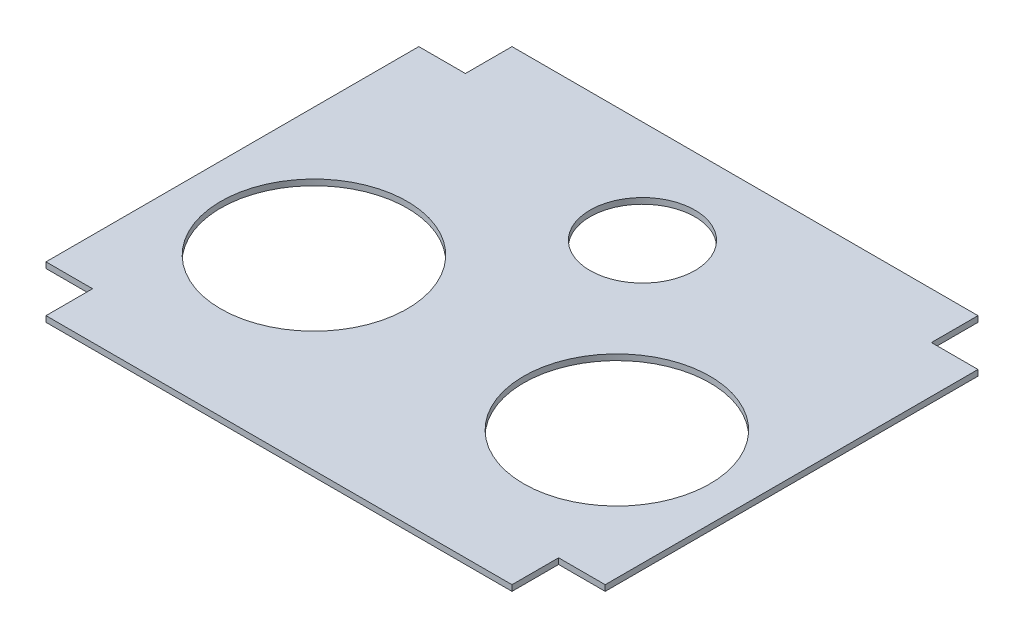
ISO-10303-21;
HEADER;
FILE_DESCRIPTION(('STEP AP214'),'2;1');
FILE_NAME('part.step','',(''),(''),'','','');
FILE_SCHEMA(('AUTOMOTIVE_DESIGN { 1 0 10303 214 1 1 1 1 }'));
ENDSEC;
DATA;
#1=APPLICATION_CONTEXT('core data for automotive mechanical design processes');
#2=APPLICATION_PROTOCOL_DEFINITION('international standard','automotive_design',2000,#1);
#3=PRODUCT_CONTEXT('',#1,'mechanical');
#4=PRODUCT('Part','Part','',(#3));
#5=PRODUCT_RELATED_PRODUCT_CATEGORY('part','',(#4));
#6=PRODUCT_DEFINITION_FORMATION('','',#4);
#7=PRODUCT_DEFINITION_CONTEXT('part definition',#1,'design');
#8=PRODUCT_DEFINITION('design','',#6,#7);
#9=PRODUCT_DEFINITION_SHAPE('','',#8);
#10=(LENGTH_UNIT() NAMED_UNIT(*) SI_UNIT(.MILLI.,.METRE.));
#11=(NAMED_UNIT(*) PLANE_ANGLE_UNIT() SI_UNIT($,.RADIAN.));
#12=(NAMED_UNIT(*) SI_UNIT($,.STERADIAN.) SOLID_ANGLE_UNIT());
#13=UNCERTAINTY_MEASURE_WITH_UNIT(LENGTH_MEASURE(1.E-05),#10,'distance_accuracy_value','');
#14=(GEOMETRIC_REPRESENTATION_CONTEXT(3) GLOBAL_UNCERTAINTY_ASSIGNED_CONTEXT((#13)) GLOBAL_UNIT_ASSIGNED_CONTEXT((#10,
#11,#12)) REPRESENTATION_CONTEXT('',''));
#15=CARTESIAN_POINT('',(0.,0.,0.));
#16=DIRECTION('',(0.,0.,1.));
#17=DIRECTION('',(1.,0.,0.));
#18=AXIS2_PLACEMENT_3D('',#15,#16,#17);
#19=CARTESIAN_POINT('',(0.,6.35,0.));
#20=DIRECTION('',(0.,1.,0.));
#21=DIRECTION('',(0.,0.,1.));
#22=AXIS2_PLACEMENT_3D('',#19,#20,#21);
#23=PLANE('',#22);
#24=CARTESIAN_POINT('',(-88.9,6.35,-152.4));
#25=DIRECTION('',(0.,1.,0.));
#26=DIRECTION('',(0.,0.,1.));
#27=AXIS2_PLACEMENT_3D('',#24,#25,#26);
#28=CIRCLE('',#27,101.6);
#29=CARTESIAN_POINT('',(-88.9,6.35,-50.7999999999999));
#30=VERTEX_POINT('',#29);
#31=EDGE_CURVE('E292',#30,#30,#28,.T.);
#32=ORIENTED_EDGE('',*,*,#31,.F.);
#33=EDGE_LOOP('',(#32));
#34=FACE_BOUND('',#33,.T.);
#35=DIRECTION('',(1.,0.,0.));
#36=VECTOR('',#35,1.);
#37=CARTESIAN_POINT('',(50.8,6.35,0.));
#38=LINE('',#37,#36);
#39=CARTESIAN_POINT('',(0.,6.35,0.));
#40=VERTEX_POINT('',#39);
#41=CARTESIAN_POINT('',(50.8,6.35,0.));
#42=VERTEX_POINT('',#41);
#43=EDGE_CURVE('E183',#40,#42,#38,.T.);
#44=ORIENTED_EDGE('',*,*,#43,.T.);
#45=DIRECTION('',(0.,0.,-1.));
#46=VECTOR('',#45,1.);
#47=CARTESIAN_POINT('',(50.7999999999999,6.35,-406.4));
#48=LINE('',#47,#46);
#49=CARTESIAN_POINT('',(50.7999999999999,6.35,-406.4));
#50=VERTEX_POINT('',#49);
#51=EDGE_CURVE('E111',#42,#50,#48,.T.);
#52=ORIENTED_EDGE('',*,*,#51,.T.);
#53=DIRECTION('',(-1.,0.,0.));
#54=VECTOR('',#53,1.);
#55=CARTESIAN_POINT('',(0.,6.35,-406.4));
#56=LINE('',#55,#54);
#57=CARTESIAN_POINT('',(0.,6.35,-406.4));
#58=VERTEX_POINT('',#57);
#59=EDGE_CURVE('E210',#50,#58,#56,.T.);
#60=ORIENTED_EDGE('',*,*,#59,.T.);
#61=DIRECTION('',(0.,0.,-1.));
#62=VECTOR('',#61,1.);
#63=CARTESIAN_POINT('',(0.,6.35,-457.2));
#64=LINE('',#63,#62);
#65=CARTESIAN_POINT('',(0.,6.35,-457.2));
#66=VERTEX_POINT('',#65);
#67=EDGE_CURVE('E229',#58,#66,#64,.T.);
#68=ORIENTED_EDGE('',*,*,#67,.T.);
#69=DIRECTION('',(-1.,0.,0.));
#70=VECTOR('',#69,1.);
#71=CARTESIAN_POINT('',(-508.,6.35,-457.2));
#72=LINE('',#71,#70);
#73=CARTESIAN_POINT('',(-508.,6.35,-457.2));
#74=VERTEX_POINT('',#73);
#75=EDGE_CURVE('E226',#66,#74,#72,.T.);
#76=ORIENTED_EDGE('',*,*,#75,.T.);
#77=DIRECTION('',(0.,0.,1.));
#78=VECTOR('',#77,1.);
#79=CARTESIAN_POINT('',(-508.,6.35,-406.4));
#80=LINE('',#79,#78);
#81=CARTESIAN_POINT('',(-508.,6.35,-406.4));
#82=VERTEX_POINT('',#81);
#83=EDGE_CURVE('E228',#74,#82,#80,.T.);
#84=ORIENTED_EDGE('',*,*,#83,.T.);
#85=DIRECTION('',(-1.,0.,0.));
#86=VECTOR('',#85,1.);
#87=CARTESIAN_POINT('',(-558.8,6.35,-406.4));
#88=LINE('',#87,#86);
#89=CARTESIAN_POINT('',(-558.8,6.35,-406.4));
#90=VERTEX_POINT('',#89);
#91=EDGE_CURVE('E231',#82,#90,#88,.T.);
#92=ORIENTED_EDGE('',*,*,#91,.T.);
#93=DIRECTION('',(0.,0.,1.));
#94=VECTOR('',#93,1.);
#95=CARTESIAN_POINT('',(-558.8,6.35,0.));
#96=LINE('',#95,#94);
#97=CARTESIAN_POINT('',(-558.8,6.35,0.));
#98=VERTEX_POINT('',#97);
#99=EDGE_CURVE('E237',#90,#98,#96,.T.);
#100=ORIENTED_EDGE('',*,*,#99,.T.);
#101=DIRECTION('',(1.,0.,0.));
#102=VECTOR('',#101,1.);
#103=CARTESIAN_POINT('',(-508.,6.35,0.));
#104=LINE('',#103,#102);
#105=CARTESIAN_POINT('',(-508.,6.35,0.));
#106=VERTEX_POINT('',#105);
#107=EDGE_CURVE('E142',#98,#106,#104,.T.);
#108=ORIENTED_EDGE('',*,*,#107,.T.);
#109=DIRECTION('',(0.,0.,1.));
#110=VECTOR('',#109,1.);
#111=CARTESIAN_POINT('',(-508.,6.35,50.8000000000001));
#112=LINE('',#111,#110);
#113=CARTESIAN_POINT('',(-508.,6.35,50.8000000000001));
#114=VERTEX_POINT('',#113);
#115=EDGE_CURVE('E136',#106,#114,#112,.T.);
#116=ORIENTED_EDGE('',*,*,#115,.T.);
#117=DIRECTION('',(1.,0.,0.));
#118=VECTOR('',#117,1.);
#119=CARTESIAN_POINT('',(0.,6.35,50.8));
#120=LINE('',#119,#118);
#121=CARTESIAN_POINT('',(0.,6.35,50.8));
#122=VERTEX_POINT('',#121);
#123=EDGE_CURVE('E140',#114,#122,#120,.T.);
#124=ORIENTED_EDGE('',*,*,#123,.T.);
#125=DIRECTION('',(0.,0.,-1.));
#126=VECTOR('',#125,1.);
#127=CARTESIAN_POINT('',(0.,6.35,0.));
#128=LINE('',#127,#126);
#129=EDGE_CURVE('E56',#122,#40,#128,.T.);
#130=ORIENTED_EDGE('',*,*,#129,.T.);
#131=EDGE_LOOP('',(#44,#52,#60,#68,#76,#84,#92,#100,#108,#116,#124,#130));
#132=FACE_BOUND('',#131,.T.);
#133=CARTESIAN_POINT('',(-419.1,6.35,-152.4));
#134=DIRECTION('',(0.,1.,0.));
#135=DIRECTION('',(0.,0.,1.));
#136=AXIS2_PLACEMENT_3D('',#133,#134,#135);
#137=CIRCLE('',#136,101.6);
#138=CARTESIAN_POINT('',(-419.1,6.35,-50.8));
#139=VERTEX_POINT('',#138);
#140=EDGE_CURVE('E164',#139,#139,#137,.T.);
#141=ORIENTED_EDGE('',*,*,#140,.F.);
#142=EDGE_LOOP('',(#141));
#143=FACE_BOUND('',#142,.T.);
#144=CARTESIAN_POINT('',(-254.,6.35,-345.423288750347));
#145=DIRECTION('',(0.,1.,0.));
#146=DIRECTION('',(0.,0.,1.));
#147=AXIS2_PLACEMENT_3D('',#144,#145,#146);
#148=CIRCLE('',#147,57.15);
#149=CARTESIAN_POINT('',(-254.,6.35,-288.273288750347));
#150=VERTEX_POINT('',#149);
#151=EDGE_CURVE('E283',#150,#150,#148,.T.);
#152=ORIENTED_EDGE('',*,*,#151,.F.);
#153=EDGE_LOOP('',(#152));
#154=FACE_BOUND('',#153,.T.);
#155=ADVANCED_FACE('F39',(#34,#132,#143,#154),#23,.T.);
#156=CARTESIAN_POINT('',(0.,0.,0.));
#157=DIRECTION('',(0.,1.,0.));
#158=DIRECTION('',(0.,0.,1.));
#159=AXIS2_PLACEMENT_3D('',#156,#157,#158);
#160=PLANE('',#159);
#161=DIRECTION('',(1.,0.,0.));
#162=VECTOR('',#161,1.);
#163=CARTESIAN_POINT('',(50.8,0.,0.));
#164=LINE('',#163,#162);
#165=CARTESIAN_POINT('',(0.,0.,0.));
#166=VERTEX_POINT('',#165);
#167=CARTESIAN_POINT('',(50.8,0.,0.));
#168=VERTEX_POINT('',#167);
#169=EDGE_CURVE('E160',#166,#168,#164,.T.);
#170=ORIENTED_EDGE('',*,*,#169,.F.);
#171=DIRECTION('',(0.,0.,-1.));
#172=VECTOR('',#171,1.);
#173=CARTESIAN_POINT('',(0.,0.,0.));
#174=LINE('',#173,#172);
#175=CARTESIAN_POINT('',(0.,0.,50.8));
#176=VERTEX_POINT('',#175);
#177=EDGE_CURVE('E103',#176,#166,#174,.T.);
#178=ORIENTED_EDGE('',*,*,#177,.F.);
#179=DIRECTION('',(1.,0.,0.));
#180=VECTOR('',#179,1.);
#181=CARTESIAN_POINT('',(0.,0.,50.8));
#182=LINE('',#181,#180);
#183=CARTESIAN_POINT('',(-508.,0.,50.8000000000001));
#184=VERTEX_POINT('',#183);
#185=EDGE_CURVE('E97',#184,#176,#182,.T.);
#186=ORIENTED_EDGE('',*,*,#185,.F.);
#187=DIRECTION('',(0.,0.,1.));
#188=VECTOR('',#187,1.);
#189=CARTESIAN_POINT('',(-508.,0.,50.8000000000001));
#190=LINE('',#189,#188);
#191=CARTESIAN_POINT('',(-508.,0.,0.));
#192=VERTEX_POINT('',#191);
#193=EDGE_CURVE('E150',#192,#184,#190,.T.);
#194=ORIENTED_EDGE('',*,*,#193,.F.);
#195=DIRECTION('',(1.,0.,0.));
#196=VECTOR('',#195,1.);
#197=CARTESIAN_POINT('',(-508.,0.,0.));
#198=LINE('',#197,#196);
#199=CARTESIAN_POINT('',(-558.8,0.,0.));
#200=VERTEX_POINT('',#199);
#201=EDGE_CURVE('E178',#200,#192,#198,.T.);
#202=ORIENTED_EDGE('',*,*,#201,.F.);
#203=DIRECTION('',(0.,0.,1.));
#204=VECTOR('',#203,1.);
#205=CARTESIAN_POINT('',(-558.8,0.,0.));
#206=LINE('',#205,#204);
#207=CARTESIAN_POINT('',(-558.8,0.,-406.4));
#208=VERTEX_POINT('',#207);
#209=EDGE_CURVE('E176',#208,#200,#206,.T.);
#210=ORIENTED_EDGE('',*,*,#209,.F.);
#211=DIRECTION('',(-1.,0.,0.));
#212=VECTOR('',#211,1.);
#213=CARTESIAN_POINT('',(-558.8,0.,-406.4));
#214=LINE('',#213,#212);
#215=CARTESIAN_POINT('',(-508.,0.,-406.4));
#216=VERTEX_POINT('',#215);
#217=EDGE_CURVE('E174',#216,#208,#214,.T.);
#218=ORIENTED_EDGE('',*,*,#217,.F.);
#219=DIRECTION('',(0.,0.,1.));
#220=VECTOR('',#219,1.);
#221=CARTESIAN_POINT('',(-508.,0.,-406.4));
#222=LINE('',#221,#220);
#223=CARTESIAN_POINT('',(-508.,0.,-457.2));
#224=VERTEX_POINT('',#223);
#225=EDGE_CURVE('E172',#224,#216,#222,.T.);
#226=ORIENTED_EDGE('',*,*,#225,.F.);
#227=DIRECTION('',(-1.,0.,0.));
#228=VECTOR('',#227,1.);
#229=CARTESIAN_POINT('',(-508.,0.,-457.2));
#230=LINE('',#229,#228);
#231=CARTESIAN_POINT('',(0.,0.,-457.2));
#232=VERTEX_POINT('',#231);
#233=EDGE_CURVE('E170',#232,#224,#230,.T.);
#234=ORIENTED_EDGE('',*,*,#233,.F.);
#235=DIRECTION('',(0.,0.,-1.));
#236=VECTOR('',#235,1.);
#237=CARTESIAN_POINT('',(0.,0.,-457.2));
#238=LINE('',#237,#236);
#239=CARTESIAN_POINT('',(0.,0.,-406.4));
#240=VERTEX_POINT('',#239);
#241=EDGE_CURVE('E168',#240,#232,#238,.T.);
#242=ORIENTED_EDGE('',*,*,#241,.F.);
#243=DIRECTION('',(-1.,0.,0.));
#244=VECTOR('',#243,1.);
#245=CARTESIAN_POINT('',(0.,0.,-406.4));
#246=LINE('',#245,#244);
#247=CARTESIAN_POINT('',(50.7999999999999,0.,-406.4));
#248=VERTEX_POINT('',#247);
#249=EDGE_CURVE('E166',#248,#240,#246,.T.);
#250=ORIENTED_EDGE('',*,*,#249,.F.);
#251=DIRECTION('',(0.,0.,-1.));
#252=VECTOR('',#251,1.);
#253=CARTESIAN_POINT('',(50.7999999999999,0.,-406.4));
#254=LINE('',#253,#252);
#255=EDGE_CURVE('E163',#168,#248,#254,.T.);
#256=ORIENTED_EDGE('',*,*,#255,.F.);
#257=EDGE_LOOP('',(#170,#178,#186,#194,#202,#210,#218,#226,#234,#242,#250,#256));
#258=FACE_BOUND('',#257,.T.);
#259=CARTESIAN_POINT('',(-419.1,0.,-152.4));
#260=DIRECTION('',(0.,1.,0.));
#261=DIRECTION('',(0.,0.,1.));
#262=AXIS2_PLACEMENT_3D('',#259,#260,#261);
#263=CIRCLE('',#262,101.6);
#264=CARTESIAN_POINT('',(-419.1,0.,-50.8));
#265=VERTEX_POINT('',#264);
#266=EDGE_CURVE('E295',#265,#265,#263,.T.);
#267=ORIENTED_EDGE('',*,*,#266,.T.);
#268=EDGE_LOOP('',(#267));
#269=FACE_BOUND('',#268,.T.);
#270=CARTESIAN_POINT('',(-88.9,0.,-152.4));
#271=DIRECTION('',(0.,1.,0.));
#272=DIRECTION('',(0.,0.,1.));
#273=AXIS2_PLACEMENT_3D('',#270,#271,#272);
#274=CIRCLE('',#273,101.6);
#275=CARTESIAN_POINT('',(-88.9,0.,-50.7999999999999));
#276=VERTEX_POINT('',#275);
#277=EDGE_CURVE('E289',#276,#276,#274,.T.);
#278=ORIENTED_EDGE('',*,*,#277,.T.);
#279=EDGE_LOOP('',(#278));
#280=FACE_BOUND('',#279,.T.);
#281=CARTESIAN_POINT('',(-254.,0.,-345.423288750347));
#282=DIRECTION('',(0.,1.,0.));
#283=DIRECTION('',(0.,0.,1.));
#284=AXIS2_PLACEMENT_3D('',#281,#282,#283);
#285=CIRCLE('',#284,57.15);
#286=CARTESIAN_POINT('',(-254.,0.,-288.273288750347));
#287=VERTEX_POINT('',#286);
#288=EDGE_CURVE('E286',#287,#287,#285,.T.);
#289=ORIENTED_EDGE('',*,*,#288,.T.);
#290=EDGE_LOOP('',(#289));
#291=FACE_BOUND('',#290,.T.);
#292=ADVANCED_FACE('F214',(#258,#269,#280,#291),#160,.F.);
#293=CARTESIAN_POINT('',(50.8,6.35,0.));
#294=DIRECTION('',(0.,0.,-1.));
#295=DIRECTION('',(-1.,0.,0.));
#296=AXIS2_PLACEMENT_3D('',#293,#294,#295);
#297=PLANE('',#296);
#298=ORIENTED_EDGE('',*,*,#169,.T.);
#299=DIRECTION('',(0.,-1.,0.));
#300=VECTOR('',#299,1.);
#301=CARTESIAN_POINT('',(50.8,6.35,0.));
#302=LINE('',#301,#300);
#303=EDGE_CURVE('E11',#42,#168,#302,.T.);
#304=ORIENTED_EDGE('',*,*,#303,.F.);
#305=ORIENTED_EDGE('',*,*,#43,.F.);
#306=DIRECTION('',(0.,-1.,0.));
#307=VECTOR('',#306,1.);
#308=CARTESIAN_POINT('',(0.,6.35,0.));
#309=LINE('',#308,#307);
#310=EDGE_CURVE('E156',#40,#166,#309,.T.);
#311=ORIENTED_EDGE('',*,*,#310,.T.);
#312=EDGE_LOOP('',(#298,#304,#305,#311));
#313=FACE_BOUND('',#312,.T.);
#314=ADVANCED_FACE('F41',(#313),#297,.F.);
#315=CARTESIAN_POINT('',(50.7999999999999,6.35,-406.4));
#316=DIRECTION('',(-1.,0.,0.));
#317=DIRECTION('',(0.,0.,1.));
#318=AXIS2_PLACEMENT_3D('',#315,#316,#317);
#319=PLANE('',#318);
#320=ORIENTED_EDGE('',*,*,#255,.T.);
#321=DIRECTION('',(0.,-1.,0.));
#322=VECTOR('',#321,1.);
#323=CARTESIAN_POINT('',(50.7999999999999,6.35,-406.4));
#324=LINE('',#323,#322);
#325=EDGE_CURVE('E48',#50,#248,#324,.T.);
#326=ORIENTED_EDGE('',*,*,#325,.F.);
#327=ORIENTED_EDGE('',*,*,#51,.F.);
#328=ORIENTED_EDGE('',*,*,#303,.T.);
#329=EDGE_LOOP('',(#320,#326,#327,#328));
#330=FACE_BOUND('',#329,.T.);
#331=ADVANCED_FACE('F397',(#330),#319,.F.);
#332=CARTESIAN_POINT('',(0.,6.35,-406.4));
#333=DIRECTION('',(0.,0.,1.));
#334=DIRECTION('',(1.,0.,0.));
#335=AXIS2_PLACEMENT_3D('',#332,#333,#334);
#336=PLANE('',#335);
#337=ORIENTED_EDGE('',*,*,#249,.T.);
#338=DIRECTION('',(0.,-1.,0.));
#339=VECTOR('',#338,1.);
#340=CARTESIAN_POINT('',(0.,6.35,-406.4));
#341=LINE('',#340,#339);
#342=EDGE_CURVE('E202',#58,#240,#341,.T.);
#343=ORIENTED_EDGE('',*,*,#342,.F.);
#344=ORIENTED_EDGE('',*,*,#59,.F.);
#345=ORIENTED_EDGE('',*,*,#325,.T.);
#346=EDGE_LOOP('',(#337,#343,#344,#345));
#347=FACE_BOUND('',#346,.T.);
#348=ADVANCED_FACE('F208',(#347),#336,.F.);
#349=CARTESIAN_POINT('',(0.,6.35,-457.2));
#350=DIRECTION('',(-1.,0.,0.));
#351=DIRECTION('',(0.,0.,1.));
#352=AXIS2_PLACEMENT_3D('',#349,#350,#351);
#353=PLANE('',#352);
#354=ORIENTED_EDGE('',*,*,#241,.T.);
#355=DIRECTION('',(0.,-1.,0.));
#356=VECTOR('',#355,1.);
#357=CARTESIAN_POINT('',(0.,6.35,-457.2));
#358=LINE('',#357,#356);
#359=EDGE_CURVE('E199',#66,#232,#358,.T.);
#360=ORIENTED_EDGE('',*,*,#359,.F.);
#361=ORIENTED_EDGE('',*,*,#67,.F.);
#362=ORIENTED_EDGE('',*,*,#342,.T.);
#363=EDGE_LOOP('',(#354,#360,#361,#362));
#364=FACE_BOUND('',#363,.T.);
#365=ADVANCED_FACE('F220',(#364),#353,.F.);
#366=CARTESIAN_POINT('',(-508.,6.35,-457.2));
#367=DIRECTION('',(0.,0.,1.));
#368=DIRECTION('',(1.,0.,0.));
#369=AXIS2_PLACEMENT_3D('',#366,#367,#368);
#370=PLANE('',#369);
#371=ORIENTED_EDGE('',*,*,#233,.T.);
#372=DIRECTION('',(0.,-1.,0.));
#373=VECTOR('',#372,1.);
#374=CARTESIAN_POINT('',(-508.,6.35,-457.2));
#375=LINE('',#374,#373);
#376=EDGE_CURVE('E196',#74,#224,#375,.T.);
#377=ORIENTED_EDGE('',*,*,#376,.F.);
#378=ORIENTED_EDGE('',*,*,#75,.F.);
#379=ORIENTED_EDGE('',*,*,#359,.T.);
#380=EDGE_LOOP('',(#371,#377,#378,#379));
#381=FACE_BOUND('',#380,.T.);
#382=ADVANCED_FACE('F224',(#381),#370,.F.);
#383=CARTESIAN_POINT('',(-508.,6.35,-406.4));
#384=DIRECTION('',(1.,0.,0.));
#385=DIRECTION('',(0.,0.,-1.));
#386=AXIS2_PLACEMENT_3D('',#383,#384,#385);
#387=PLANE('',#386);
#388=ORIENTED_EDGE('',*,*,#225,.T.);
#389=DIRECTION('',(0.,-1.,0.));
#390=VECTOR('',#389,1.);
#391=CARTESIAN_POINT('',(-508.,6.35,-406.4));
#392=LINE('',#391,#390);
#393=EDGE_CURVE('E193',#82,#216,#392,.T.);
#394=ORIENTED_EDGE('',*,*,#393,.F.);
#395=ORIENTED_EDGE('',*,*,#83,.F.);
#396=ORIENTED_EDGE('',*,*,#376,.T.);
#397=EDGE_LOOP('',(#388,#394,#395,#396));
#398=FACE_BOUND('',#397,.T.);
#399=ADVANCED_FACE('F362',(#398),#387,.F.);
#400=CARTESIAN_POINT('',(-558.8,6.35,-406.4));
#401=DIRECTION('',(0.,0.,1.));
#402=DIRECTION('',(1.,0.,0.));
#403=AXIS2_PLACEMENT_3D('',#400,#401,#402);
#404=PLANE('',#403);
#405=ORIENTED_EDGE('',*,*,#217,.T.);
#406=DIRECTION('',(0.,-1.,0.));
#407=VECTOR('',#406,1.);
#408=CARTESIAN_POINT('',(-558.8,6.35,-406.4));
#409=LINE('',#408,#407);
#410=EDGE_CURVE('E190',#90,#208,#409,.T.);
#411=ORIENTED_EDGE('',*,*,#410,.F.);
#412=ORIENTED_EDGE('',*,*,#91,.F.);
#413=ORIENTED_EDGE('',*,*,#393,.T.);
#414=EDGE_LOOP('',(#405,#411,#412,#413));
#415=FACE_BOUND('',#414,.T.);
#416=ADVANCED_FACE('F353',(#415),#404,.F.);
#417=CARTESIAN_POINT('',(-558.8,6.35,0.));
#418=DIRECTION('',(1.,0.,0.));
#419=DIRECTION('',(0.,0.,-1.));
#420=AXIS2_PLACEMENT_3D('',#417,#418,#419);
#421=PLANE('',#420);
#422=ORIENTED_EDGE('',*,*,#209,.T.);
#423=DIRECTION('',(0.,-1.,0.));
#424=VECTOR('',#423,1.);
#425=CARTESIAN_POINT('',(-558.8,6.35,0.));
#426=LINE('',#425,#424);
#427=EDGE_CURVE('E187',#98,#200,#426,.T.);
#428=ORIENTED_EDGE('',*,*,#427,.F.);
#429=ORIENTED_EDGE('',*,*,#99,.F.);
#430=ORIENTED_EDGE('',*,*,#410,.T.);
#431=EDGE_LOOP('',(#422,#428,#429,#430));
#432=FACE_BOUND('',#431,.T.);
#433=ADVANCED_FACE('F243',(#432),#421,.F.);
#434=CARTESIAN_POINT('',(-508.,6.35,0.));
#435=DIRECTION('',(0.,0.,-1.));
#436=DIRECTION('',(-1.,0.,0.));
#437=AXIS2_PLACEMENT_3D('',#434,#435,#436);
#438=PLANE('',#437);
#439=ORIENTED_EDGE('',*,*,#201,.T.);
#440=DIRECTION('',(0.,-1.,0.));
#441=VECTOR('',#440,1.);
#442=CARTESIAN_POINT('',(-508.,6.35,0.));
#443=LINE('',#442,#441);
#444=EDGE_CURVE('E151',#106,#192,#443,.T.);
#445=ORIENTED_EDGE('',*,*,#444,.F.);
#446=ORIENTED_EDGE('',*,*,#107,.F.);
#447=ORIENTED_EDGE('',*,*,#427,.T.);
#448=EDGE_LOOP('',(#439,#445,#446,#447));
#449=FACE_BOUND('',#448,.T.);
#450=ADVANCED_FACE('F247',(#449),#438,.F.);
#451=CARTESIAN_POINT('',(-508.,6.35,50.8000000000001));
#452=DIRECTION('',(1.,0.,0.));
#453=DIRECTION('',(0.,0.,-1.));
#454=AXIS2_PLACEMENT_3D('',#451,#452,#453);
#455=PLANE('',#454);
#456=ORIENTED_EDGE('',*,*,#193,.T.);
#457=DIRECTION('',(0.,-1.,0.));
#458=VECTOR('',#457,1.);
#459=CARTESIAN_POINT('',(-508.,6.35,50.8000000000001));
#460=LINE('',#459,#458);
#461=EDGE_CURVE('E147',#114,#184,#460,.T.);
#462=ORIENTED_EDGE('',*,*,#461,.F.);
#463=ORIENTED_EDGE('',*,*,#115,.F.);
#464=ORIENTED_EDGE('',*,*,#444,.T.);
#465=EDGE_LOOP('',(#456,#462,#463,#464));
#466=FACE_BOUND('',#465,.T.);
#467=ADVANCED_FACE('F148',(#466),#455,.F.);
#468=CARTESIAN_POINT('',(0.,6.35,50.8));
#469=DIRECTION('',(0.,0.,-1.));
#470=DIRECTION('',(-1.,0.,0.));
#471=AXIS2_PLACEMENT_3D('',#468,#469,#470);
#472=PLANE('',#471);
#473=ORIENTED_EDGE('',*,*,#185,.T.);
#474=DIRECTION('',(0.,-1.,0.));
#475=VECTOR('',#474,1.);
#476=CARTESIAN_POINT('',(0.,6.35,50.8));
#477=LINE('',#476,#475);
#478=EDGE_CURVE('E152',#122,#176,#477,.T.);
#479=ORIENTED_EDGE('',*,*,#478,.F.);
#480=ORIENTED_EDGE('',*,*,#123,.F.);
#481=ORIENTED_EDGE('',*,*,#461,.T.);
#482=EDGE_LOOP('',(#473,#479,#480,#481));
#483=FACE_BOUND('',#482,.T.);
#484=ADVANCED_FACE('F154',(#483),#472,.F.);
#485=CARTESIAN_POINT('',(0.,6.35,0.));
#486=DIRECTION('',(-1.,0.,0.));
#487=DIRECTION('',(0.,0.,1.));
#488=AXIS2_PLACEMENT_3D('',#485,#486,#487);
#489=PLANE('',#488);
#490=ORIENTED_EDGE('',*,*,#177,.T.);
#491=ORIENTED_EDGE('',*,*,#310,.F.);
#492=ORIENTED_EDGE('',*,*,#129,.F.);
#493=ORIENTED_EDGE('',*,*,#478,.T.);
#494=EDGE_LOOP('',(#490,#491,#492,#493));
#495=FACE_BOUND('',#494,.T.);
#496=ADVANCED_FACE('F251',(#495),#489,.F.);
#497=CARTESIAN_POINT('',(-419.1,6.35,-152.4));
#498=DIRECTION('',(0.,-1.,0.));
#499=DIRECTION('',(0.,0.,-1.));
#500=AXIS2_PLACEMENT_3D('',#497,#498,#499);
#501=CYLINDRICAL_SURFACE('',#500,101.6);
#502=ORIENTED_EDGE('',*,*,#140,.T.);
#503=EDGE_LOOP('',(#502));
#504=FACE_BOUND('',#503,.T.);
#505=ORIENTED_EDGE('',*,*,#266,.F.);
#506=EDGE_LOOP('',(#505));
#507=FACE_BOUND('',#506,.T.);
#508=ADVANCED_FACE('F253',(#504,#507),#501,.F.);
#509=CARTESIAN_POINT('',(-88.9,6.35,-152.4));
#510=DIRECTION('',(0.,-1.,0.));
#511=DIRECTION('',(0.,0.,-1.));
#512=AXIS2_PLACEMENT_3D('',#509,#510,#511);
#513=CYLINDRICAL_SURFACE('',#512,101.6);
#514=ORIENTED_EDGE('',*,*,#31,.T.);
#515=EDGE_LOOP('',(#514));
#516=FACE_BOUND('',#515,.T.);
#517=ORIENTED_EDGE('',*,*,#277,.F.);
#518=EDGE_LOOP('',(#517));
#519=FACE_BOUND('',#518,.T.);
#520=ADVANCED_FACE('F259',(#516,#519),#513,.F.);
#521=CARTESIAN_POINT('',(-254.,6.35,-345.423288750347));
#522=DIRECTION('',(0.,-1.,0.));
#523=DIRECTION('',(0.,0.,-1.));
#524=AXIS2_PLACEMENT_3D('',#521,#522,#523);
#525=CYLINDRICAL_SURFACE('',#524,57.15);
#526=ORIENTED_EDGE('',*,*,#151,.T.);
#527=EDGE_LOOP('',(#526));
#528=FACE_BOUND('',#527,.T.);
#529=ORIENTED_EDGE('',*,*,#288,.F.);
#530=EDGE_LOOP('',(#529));
#531=FACE_BOUND('',#530,.T.);
#532=ADVANCED_FACE('F274',(#528,#531),#525,.F.);
#533=CLOSED_SHELL('',(#155,#292,#314,#331,#348,#365,#382,#399,#416,#433,#450,#467,#484,#496,
#508,#520,#532));
#534=MANIFOLD_SOLID_BREP('B2',#533);
#535=ADVANCED_BREP_SHAPE_REPRESENTATION('',(#18,#534),#14);
#536=SHAPE_DEFINITION_REPRESENTATION(#9,#535);
ENDSEC;
END-ISO-10303-21;
